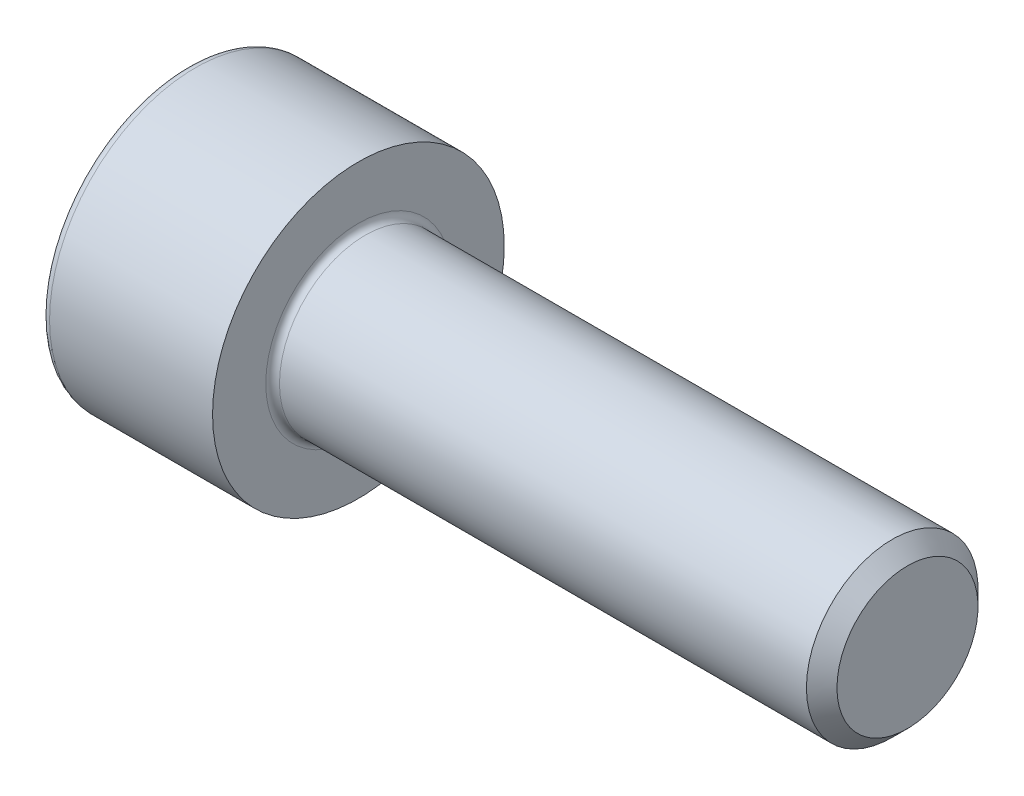
ISO-10303-21;
HEADER;
FILE_DESCRIPTION(('STEP AP214'),'2;1');
FILE_NAME('part.step','',(''),(''),'','','');
FILE_SCHEMA(('AUTOMOTIVE_DESIGN { 1 0 10303 214 1 1 1 1 }'));
ENDSEC;
DATA;
#1=APPLICATION_CONTEXT('core data for automotive mechanical design processes');
#2=APPLICATION_PROTOCOL_DEFINITION('international standard','automotive_design',2000,#1);
#3=PRODUCT_CONTEXT('',#1,'mechanical');
#4=PRODUCT('Part','Part','',(#3));
#5=PRODUCT_RELATED_PRODUCT_CATEGORY('part','',(#4));
#6=PRODUCT_DEFINITION_FORMATION('','',#4);
#7=PRODUCT_DEFINITION_CONTEXT('part definition',#1,'design');
#8=PRODUCT_DEFINITION('design','',#6,#7);
#9=PRODUCT_DEFINITION_SHAPE('','',#8);
#10=(LENGTH_UNIT() NAMED_UNIT(*) SI_UNIT(.MILLI.,.METRE.));
#11=(NAMED_UNIT(*) PLANE_ANGLE_UNIT() SI_UNIT($,.RADIAN.));
#12=(NAMED_UNIT(*) SI_UNIT($,.STERADIAN.) SOLID_ANGLE_UNIT());
#13=UNCERTAINTY_MEASURE_WITH_UNIT(LENGTH_MEASURE(1.E-05),#10,'distance_accuracy_value','');
#14=(GEOMETRIC_REPRESENTATION_CONTEXT(3) GLOBAL_UNCERTAINTY_ASSIGNED_CONTEXT((#13)) GLOBAL_UNIT_ASSIGNED_CONTEXT((#10,
#11,#12)) REPRESENTATION_CONTEXT('',''));
#15=CARTESIAN_POINT('',(0.,0.,0.));
#16=DIRECTION('',(0.,0.,1.));
#17=DIRECTION('',(1.,0.,0.));
#18=AXIS2_PLACEMENT_3D('',#15,#16,#17);
#19=CARTESIAN_POINT('',(0.,0.,0.));
#20=DIRECTION('',(-1.,0.,0.));
#21=DIRECTION('',(0.,0.,1.));
#22=AXIS2_PLACEMENT_3D('',#19,#20,#21);
#23=PLANE('',#22);
#24=DIRECTION('',(0.,-0.499999999999999,0.866025403784439));
#25=VECTOR('',#24,1.);
#26=CARTESIAN_POINT('',(0.,2.35789849937043,0.));
#27=LINE('',#26,#25);
#28=CARTESIAN_POINT('',(0.,2.35789849937043,0.));
#29=VERTEX_POINT('',#28);
#30=CARTESIAN_POINT('',(0.,1.17894924968522,2.042));
#31=VERTEX_POINT('',#30);
#32=EDGE_CURVE('E261',#29,#31,#27,.T.);
#33=ORIENTED_EDGE('',*,*,#32,.T.);
#34=DIRECTION('',(0.,1.,0.));
#35=VECTOR('',#34,1.);
#36=CARTESIAN_POINT('',(0.,-1.17894924968522,2.042));
#37=LINE('',#36,#35);
#38=CARTESIAN_POINT('',(0.,-1.17894924968522,2.042));
#39=VERTEX_POINT('',#38);
#40=EDGE_CURVE('E122',#39,#31,#37,.T.);
#41=ORIENTED_EDGE('',*,*,#40,.F.);
#42=DIRECTION('',(0.,-0.500000000000001,-0.866025403784438));
#43=VECTOR('',#42,1.);
#44=CARTESIAN_POINT('',(0.,-1.17894924968522,2.042));
#45=LINE('',#44,#43);
#46=CARTESIAN_POINT('',(0.,-2.35789849937043,0.));
#47=VERTEX_POINT('',#46);
#48=EDGE_CURVE('E264',#39,#47,#45,.T.);
#49=ORIENTED_EDGE('',*,*,#48,.T.);
#50=DIRECTION('',(0.,0.499999999999999,-0.866025403784439));
#51=VECTOR('',#50,1.);
#52=CARTESIAN_POINT('',(0.,-2.35789849937043,0.));
#53=LINE('',#52,#51);
#54=CARTESIAN_POINT('',(0.,-1.17894924968522,-2.042));
#55=VERTEX_POINT('',#54);
#56=EDGE_CURVE('E267',#47,#55,#53,.T.);
#57=ORIENTED_EDGE('',*,*,#56,.T.);
#58=DIRECTION('',(0.,-1.,0.));
#59=VECTOR('',#58,1.);
#60=CARTESIAN_POINT('',(0.,1.17894924968521,-2.042));
#61=LINE('',#60,#59);
#62=CARTESIAN_POINT('',(0.,1.17894924968521,-2.042));
#63=VERTEX_POINT('',#62);
#64=EDGE_CURVE('E270',#63,#55,#61,.T.);
#65=ORIENTED_EDGE('',*,*,#64,.F.);
#66=DIRECTION('',(0.,-0.500000000000001,-0.866025403784438));
#67=VECTOR('',#66,1.);
#68=CARTESIAN_POINT('',(0.,2.35789849937043,0.));
#69=LINE('',#68,#67);
#70=EDGE_CURVE('E117',#29,#63,#69,.T.);
#71=ORIENTED_EDGE('',*,*,#70,.F.);
#72=EDGE_LOOP('',(#33,#41,#49,#57,#65,#71));
#73=FACE_BOUND('',#72,.T.);
#74=CARTESIAN_POINT('',(0.,0.,0.));
#75=DIRECTION('',(-1.,0.,0.));
#76=DIRECTION('',(0.,0.,1.));
#77=AXIS2_PLACEMENT_3D('',#74,#75,#76);
#78=CIRCLE('',#77,4.);
#79=CARTESIAN_POINT('',(0.,0.,4.));
#80=VERTEX_POINT('',#79);
#81=EDGE_CURVE('E38',#80,#80,#78,.T.);
#82=ORIENTED_EDGE('',*,*,#81,.T.);
#83=EDGE_LOOP('',(#82));
#84=FACE_BOUND('',#83,.T.);
#85=ADVANCED_FACE('F30',(#73,#84),#23,.T.);
#86=CARTESIAN_POINT('',(-31.75,0.,0.));
#87=DIRECTION('',(-1.,0.,0.));
#88=DIRECTION('',(0.,0.,1.));
#89=AXIS2_PLACEMENT_3D('',#86,#87,#88);
#90=CYLINDRICAL_SURFACE('',#89,4.25);
#91=CARTESIAN_POINT('',(0.25,0.,0.));
#92=DIRECTION('',(-1.,0.,0.));
#93=DIRECTION('',(0.,0.,1.));
#94=AXIS2_PLACEMENT_3D('',#91,#92,#93);
#95=CIRCLE('',#94,4.25);
#96=CARTESIAN_POINT('',(0.25,0.,4.25));
#97=VERTEX_POINT('',#96);
#98=EDGE_CURVE('E11',#97,#97,#95,.F.);
#99=ORIENTED_EDGE('',*,*,#98,.T.);
#100=EDGE_LOOP('',(#99));
#101=FACE_BOUND('',#100,.T.);
#102=CARTESIAN_POINT('',(5.,0.,0.));
#103=DIRECTION('',(-1.,0.,0.));
#104=DIRECTION('',(0.,0.,1.));
#105=AXIS2_PLACEMENT_3D('',#102,#103,#104);
#106=CIRCLE('',#105,4.25);
#107=CARTESIAN_POINT('',(5.,0.,4.25));
#108=VERTEX_POINT('',#107);
#109=EDGE_CURVE('E140',#108,#108,#106,.T.);
#110=ORIENTED_EDGE('',*,*,#109,.T.);
#111=EDGE_LOOP('',(#110));
#112=FACE_BOUND('',#111,.T.);
#113=ADVANCED_FACE('F164',(#101,#112),#90,.T.);
#114=CARTESIAN_POINT('',(5.,4.25,0.));
#115=DIRECTION('',(1.,0.,0.));
#116=DIRECTION('',(0.,0.,-1.));
#117=AXIS2_PLACEMENT_3D('',#114,#115,#116);
#118=PLANE('',#117);
#119=CARTESIAN_POINT('',(5.,0.,0.));
#120=DIRECTION('',(1.,0.,0.));
#121=DIRECTION('',(0.,0.,-1.));
#122=AXIS2_PLACEMENT_3D('',#119,#120,#121);
#123=CIRCLE('',#122,2.7);
#124=CARTESIAN_POINT('',(5.,0.,-2.7));
#125=VERTEX_POINT('',#124);
#126=EDGE_CURVE('E143',#125,#125,#123,.F.);
#127=ORIENTED_EDGE('',*,*,#126,.T.);
#128=EDGE_LOOP('',(#127));
#129=FACE_BOUND('',#128,.T.);
#130=ORIENTED_EDGE('',*,*,#109,.F.);
#131=EDGE_LOOP('',(#130));
#132=FACE_BOUND('',#131,.T.);
#133=ADVANCED_FACE('F170',(#129,#132),#118,.T.);
#134=CARTESIAN_POINT('',(-31.75,0.,0.));
#135=DIRECTION('',(-1.,0.,0.));
#136=DIRECTION('',(0.,0.,1.));
#137=AXIS2_PLACEMENT_3D('',#134,#135,#136);
#138=CYLINDRICAL_SURFACE('',#137,2.5);
#139=CARTESIAN_POINT('',(5.2,0.,0.));
#140=DIRECTION('',(1.,0.,0.));
#141=DIRECTION('',(0.,0.,-1.));
#142=AXIS2_PLACEMENT_3D('',#139,#140,#141);
#143=CIRCLE('',#142,2.5);
#144=CARTESIAN_POINT('',(5.2,0.,-2.5));
#145=VERTEX_POINT('',#144);
#146=EDGE_CURVE('E146',#145,#145,#143,.T.);
#147=ORIENTED_EDGE('',*,*,#146,.T.);
#148=EDGE_LOOP('',(#147));
#149=FACE_BOUND('',#148,.T.);
#150=CARTESIAN_POINT('',(20.555,0.,0.));
#151=DIRECTION('',(-1.,0.,0.));
#152=DIRECTION('',(0.,0.,1.));
#153=AXIS2_PLACEMENT_3D('',#150,#151,#152);
#154=CIRCLE('',#153,2.5);
#155=CARTESIAN_POINT('',(20.555,0.,2.5));
#156=VERTEX_POINT('',#155);
#157=EDGE_CURVE('E137',#156,#156,#154,.T.);
#158=ORIENTED_EDGE('',*,*,#157,.T.);
#159=EDGE_LOOP('',(#158));
#160=FACE_BOUND('',#159,.T.);
#161=ADVANCED_FACE('F176',(#149,#160),#138,.T.);
#162=CARTESIAN_POINT('',(21.,0.,0.));
#163=DIRECTION('',(-1.,0.,0.));
#164=DIRECTION('',(0.,0.,1.));
#165=AXIS2_PLACEMENT_3D('',#162,#163,#164);
#166=CONICAL_SURFACE('',#165,2.055,0.785398163397464);
#167=ORIENTED_EDGE('',*,*,#157,.F.);
#168=EDGE_LOOP('',(#167));
#169=FACE_BOUND('',#168,.T.);
#170=CARTESIAN_POINT('',(21.,0.,0.));
#171=DIRECTION('',(-1.,0.,0.));
#172=DIRECTION('',(0.,0.,1.));
#173=AXIS2_PLACEMENT_3D('',#170,#171,#172);
#174=CIRCLE('',#173,2.055);
#175=CARTESIAN_POINT('',(21.,0.,2.055));
#176=VERTEX_POINT('',#175);
#177=EDGE_CURVE('E133',#176,#176,#174,.T.);
#178=ORIENTED_EDGE('',*,*,#177,.T.);
#179=EDGE_LOOP('',(#178));
#180=FACE_BOUND('',#179,.T.);
#181=ADVANCED_FACE('F180',(#169,#180),#166,.T.);
#182=CARTESIAN_POINT('',(21.,2.055,0.));
#183=DIRECTION('',(1.,0.,0.));
#184=DIRECTION('',(0.,0.,-1.));
#185=AXIS2_PLACEMENT_3D('',#182,#183,#184);
#186=PLANE('',#185);
#187=ORIENTED_EDGE('',*,*,#177,.F.);
#188=EDGE_LOOP('',(#187));
#189=FACE_BOUND('',#188,.T.);
#190=ADVANCED_FACE('F160',(#189),#186,.T.);
#191=CARTESIAN_POINT('',(5.2,0.,0.));
#192=DIRECTION('',(1.,0.,0.));
#193=DIRECTION('',(0.,0.,-1.));
#194=AXIS2_PLACEMENT_3D('',#191,#192,#193);
#195=TOROIDAL_SURFACE('',#194,2.7,0.2);
#196=ORIENTED_EDGE('',*,*,#146,.F.);
#197=EDGE_LOOP('',(#196));
#198=FACE_BOUND('',#197,.T.);
#199=ORIENTED_EDGE('',*,*,#126,.F.);
#200=EDGE_LOOP('',(#199));
#201=FACE_BOUND('',#200,.T.);
#202=ADVANCED_FACE('F153',(#198,#201),#195,.F.);
#203=CARTESIAN_POINT('',(0.25,0.,0.));
#204=DIRECTION('',(-1.,0.,0.));
#205=DIRECTION('',(0.,0.,1.));
#206=AXIS2_PLACEMENT_3D('',#203,#204,#205);
#207=TOROIDAL_SURFACE('',#206,4.,0.25);
#208=ORIENTED_EDGE('',*,*,#98,.F.);
#209=EDGE_LOOP('',(#208));
#210=FACE_BOUND('',#209,.T.);
#211=ORIENTED_EDGE('',*,*,#81,.F.);
#212=EDGE_LOOP('',(#211));
#213=FACE_BOUND('',#212,.T.);
#214=ADVANCED_FACE('F32',(#210,#213),#207,.T.);
#215=CARTESIAN_POINT('',(2.5,2.35789849937043,0.));
#216=DIRECTION('',(0.,-0.866025403784439,-0.499999999999999));
#217=DIRECTION('',(0.,0.499999999999999,-0.866025403784439));
#218=AXIS2_PLACEMENT_3D('',#215,#216,#217);
#219=PLANE('',#218);
#220=ORIENTED_EDGE('',*,*,#32,.F.);
#221=DIRECTION('',(-1.,0.,0.));
#222=VECTOR('',#221,1.);
#223=CARTESIAN_POINT('',(2.5,2.35789849937043,0.));
#224=LINE('',#223,#222);
#225=CARTESIAN_POINT('',(2.5,2.35789849937043,0.));
#226=VERTEX_POINT('',#225);
#227=EDGE_CURVE('E260',#226,#29,#224,.T.);
#228=ORIENTED_EDGE('',*,*,#227,.F.);
#229=DIRECTION('',(0.,-0.499999999999999,0.866025403784439));
#230=VECTOR('',#229,1.);
#231=CARTESIAN_POINT('',(2.5,2.35789849937043,0.));
#232=LINE('',#231,#230);
#233=CARTESIAN_POINT('',(2.5,1.76842387452783,1.021));
#234=VERTEX_POINT('',#233);
#235=EDGE_CURVE('E45',#226,#234,#232,.T.);
#236=ORIENTED_EDGE('',*,*,#235,.T.);
#237=CARTESIAN_POINT('',(2.5,1.17894924968522,2.042));
#238=VERTEX_POINT('',#237);
#239=EDGE_CURVE('E103',#234,#238,#232,.T.);
#240=ORIENTED_EDGE('',*,*,#239,.T.);
#241=DIRECTION('',(-1.,0.,0.));
#242=VECTOR('',#241,1.);
#243=CARTESIAN_POINT('',(2.5,1.17894924968522,2.042));
#244=LINE('',#243,#242);
#245=EDGE_CURVE('E115',#238,#31,#244,.T.);
#246=ORIENTED_EDGE('',*,*,#245,.T.);
#247=EDGE_LOOP('',(#220,#228,#236,#240,#246));
#248=FACE_BOUND('',#247,.T.);
#249=ADVANCED_FACE('F114',(#248),#219,.T.);
#250=CARTESIAN_POINT('',(2.5,-1.17894924968522,2.042));
#251=DIRECTION('',(0.,0.,1.));
#252=DIRECTION('',(0.,-1.,0.));
#253=AXIS2_PLACEMENT_3D('',#250,#251,#252);
#254=PLANE('',#253);
#255=ORIENTED_EDGE('',*,*,#40,.T.);
#256=ORIENTED_EDGE('',*,*,#245,.F.);
#257=DIRECTION('',(0.,1.,0.));
#258=VECTOR('',#257,1.);
#259=CARTESIAN_POINT('',(2.5,-1.17894924968522,2.042));
#260=LINE('',#259,#258);
#261=CARTESIAN_POINT('',(2.5,0.,2.042));
#262=VERTEX_POINT('',#261);
#263=EDGE_CURVE('E101',#262,#238,#260,.T.);
#264=ORIENTED_EDGE('',*,*,#263,.F.);
#265=CARTESIAN_POINT('',(2.5,-1.17894924968522,2.042));
#266=VERTEX_POINT('',#265);
#267=EDGE_CURVE('E111',#266,#262,#260,.T.);
#268=ORIENTED_EDGE('',*,*,#267,.F.);
#269=DIRECTION('',(-1.,0.,0.));
#270=VECTOR('',#269,1.);
#271=CARTESIAN_POINT('',(2.5,-1.17894924968522,2.042));
#272=LINE('',#271,#270);
#273=EDGE_CURVE('E124',#266,#39,#272,.T.);
#274=ORIENTED_EDGE('',*,*,#273,.T.);
#275=EDGE_LOOP('',(#255,#256,#264,#268,#274));
#276=FACE_BOUND('',#275,.T.);
#277=ADVANCED_FACE('F119',(#276),#254,.F.);
#278=CARTESIAN_POINT('',(2.5,-1.17894924968522,2.042));
#279=DIRECTION('',(0.,0.866025403784438,-0.500000000000001));
#280=DIRECTION('',(0.,0.500000000000001,0.866025403784438));
#281=AXIS2_PLACEMENT_3D('',#278,#279,#280);
#282=PLANE('',#281);
#283=ORIENTED_EDGE('',*,*,#48,.F.);
#284=ORIENTED_EDGE('',*,*,#273,.F.);
#285=DIRECTION('',(0.,-0.500000000000001,-0.866025403784438));
#286=VECTOR('',#285,1.);
#287=CARTESIAN_POINT('',(2.5,-1.17894924968522,2.042));
#288=LINE('',#287,#286);
#289=CARTESIAN_POINT('',(2.5,-1.76842387452782,1.021));
#290=VERTEX_POINT('',#289);
#291=EDGE_CURVE('E241',#266,#290,#288,.T.);
#292=ORIENTED_EDGE('',*,*,#291,.T.);
#293=CARTESIAN_POINT('',(2.5,-2.35789849937043,0.));
#294=VERTEX_POINT('',#293);
#295=EDGE_CURVE('E243',#290,#294,#288,.T.);
#296=ORIENTED_EDGE('',*,*,#295,.T.);
#297=DIRECTION('',(-1.,0.,0.));
#298=VECTOR('',#297,1.);
#299=CARTESIAN_POINT('',(2.5,-2.35789849937043,0.));
#300=LINE('',#299,#298);
#301=EDGE_CURVE('E129',#294,#47,#300,.T.);
#302=ORIENTED_EDGE('',*,*,#301,.T.);
#303=EDGE_LOOP('',(#283,#284,#292,#296,#302));
#304=FACE_BOUND('',#303,.T.);
#305=ADVANCED_FACE('F193',(#304),#282,.T.);
#306=CARTESIAN_POINT('',(2.5,-2.35789849937043,0.));
#307=DIRECTION('',(0.,0.866025403784439,0.499999999999999));
#308=DIRECTION('',(0.,-0.499999999999999,0.86602540378444));
#309=AXIS2_PLACEMENT_3D('',#306,#307,#308);
#310=PLANE('',#309);
#311=ORIENTED_EDGE('',*,*,#56,.F.);
#312=ORIENTED_EDGE('',*,*,#301,.F.);
#313=DIRECTION('',(0.,0.499999999999999,-0.866025403784439));
#314=VECTOR('',#313,1.);
#315=CARTESIAN_POINT('',(2.5,-2.35789849937043,0.));
#316=LINE('',#315,#314);
#317=CARTESIAN_POINT('',(2.5,-1.76842387452783,-1.021));
#318=VERTEX_POINT('',#317);
#319=EDGE_CURVE('E246',#294,#318,#316,.T.);
#320=ORIENTED_EDGE('',*,*,#319,.T.);
#321=CARTESIAN_POINT('',(2.5,-1.17894924968522,-2.042));
#322=VERTEX_POINT('',#321);
#323=EDGE_CURVE('E250',#318,#322,#316,.T.);
#324=ORIENTED_EDGE('',*,*,#323,.T.);
#325=DIRECTION('',(-1.,0.,0.));
#326=VECTOR('',#325,1.);
#327=CARTESIAN_POINT('',(2.5,-1.17894924968522,-2.042));
#328=LINE('',#327,#326);
#329=EDGE_CURVE('E279',#322,#55,#328,.T.);
#330=ORIENTED_EDGE('',*,*,#329,.T.);
#331=EDGE_LOOP('',(#311,#312,#320,#324,#330));
#332=FACE_BOUND('',#331,.T.);
#333=ADVANCED_FACE('F196',(#332),#310,.T.);
#334=CARTESIAN_POINT('',(2.5,1.17894924968521,-2.042));
#335=DIRECTION('',(0.,0.,-1.));
#336=DIRECTION('',(0.,1.,0.));
#337=AXIS2_PLACEMENT_3D('',#334,#335,#336);
#338=PLANE('',#337);
#339=ORIENTED_EDGE('',*,*,#64,.T.);
#340=ORIENTED_EDGE('',*,*,#329,.F.);
#341=DIRECTION('',(0.,-1.,0.));
#342=VECTOR('',#341,1.);
#343=CARTESIAN_POINT('',(2.5,1.17894924968521,-2.042));
#344=LINE('',#343,#342);
#345=CARTESIAN_POINT('',(2.5,0.,-2.042));
#346=VERTEX_POINT('',#345);
#347=EDGE_CURVE('E254',#346,#322,#344,.T.);
#348=ORIENTED_EDGE('',*,*,#347,.F.);
#349=CARTESIAN_POINT('',(2.5,1.17894924968521,-2.042));
#350=VERTEX_POINT('',#349);
#351=EDGE_CURVE('E255',#350,#346,#344,.T.);
#352=ORIENTED_EDGE('',*,*,#351,.F.);
#353=DIRECTION('',(-1.,0.,0.));
#354=VECTOR('',#353,1.);
#355=CARTESIAN_POINT('',(2.5,1.17894924968521,-2.042));
#356=LINE('',#355,#354);
#357=EDGE_CURVE('E276',#350,#63,#356,.T.);
#358=ORIENTED_EDGE('',*,*,#357,.T.);
#359=EDGE_LOOP('',(#339,#340,#348,#352,#358));
#360=FACE_BOUND('',#359,.T.);
#361=ADVANCED_FACE('F200',(#360),#338,.F.);
#362=CARTESIAN_POINT('',(2.5,2.35789849937043,0.));
#363=DIRECTION('',(0.,0.866025403784438,-0.500000000000001));
#364=DIRECTION('',(0.,0.500000000000001,0.866025403784438));
#365=AXIS2_PLACEMENT_3D('',#362,#363,#364);
#366=PLANE('',#365);
#367=ORIENTED_EDGE('',*,*,#70,.T.);
#368=ORIENTED_EDGE('',*,*,#357,.F.);
#369=DIRECTION('',(0.,-0.500000000000001,-0.866025403784438));
#370=VECTOR('',#369,1.);
#371=CARTESIAN_POINT('',(2.5,2.35789849937043,0.));
#372=LINE('',#371,#370);
#373=CARTESIAN_POINT('',(2.5,1.76842387452782,-1.021));
#374=VERTEX_POINT('',#373);
#375=EDGE_CURVE('E258',#374,#350,#372,.T.);
#376=ORIENTED_EDGE('',*,*,#375,.F.);
#377=EDGE_CURVE('E232',#226,#374,#372,.T.);
#378=ORIENTED_EDGE('',*,*,#377,.F.);
#379=ORIENTED_EDGE('',*,*,#227,.T.);
#380=EDGE_LOOP('',(#367,#368,#376,#378,#379));
#381=FACE_BOUND('',#380,.T.);
#382=ADVANCED_FACE('F204',(#381),#366,.F.);
#383=CARTESIAN_POINT('',(2.5,1.17894924968522,2.042));
#384=DIRECTION('',(-1.,0.,0.));
#385=DIRECTION('',(0.,0.,1.));
#386=AXIS2_PLACEMENT_3D('',#383,#384,#385);
#387=PLANE('',#386);
#388=CARTESIAN_POINT('',(2.5,0.,0.));
#389=DIRECTION('',(-1.,0.,0.));
#390=DIRECTION('',(0.,0.,1.));
#391=AXIS2_PLACEMENT_3D('',#388,#389,#390);
#392=CIRCLE('',#391,2.042);
#393=EDGE_CURVE('E123',#290,#262,#392,.T.);
#394=ORIENTED_EDGE('',*,*,#393,.F.);
#395=ORIENTED_EDGE('',*,*,#291,.F.);
#396=ORIENTED_EDGE('',*,*,#267,.T.);
#397=EDGE_LOOP('',(#394,#395,#396));
#398=FACE_BOUND('',#397,.T.);
#399=ADVANCED_FACE('F208',(#398),#387,.T.);
#400=EDGE_CURVE('E127',#318,#290,#392,.T.);
#401=ORIENTED_EDGE('',*,*,#400,.F.);
#402=ORIENTED_EDGE('',*,*,#319,.F.);
#403=ORIENTED_EDGE('',*,*,#295,.F.);
#404=EDGE_LOOP('',(#401,#402,#403));
#405=FACE_BOUND('',#404,.T.);
#406=ADVANCED_FACE('F211',(#405),#387,.T.);
#407=EDGE_CURVE('E285',#346,#318,#392,.T.);
#408=ORIENTED_EDGE('',*,*,#407,.F.);
#409=ORIENTED_EDGE('',*,*,#347,.T.);
#410=ORIENTED_EDGE('',*,*,#323,.F.);
#411=EDGE_LOOP('',(#408,#409,#410));
#412=FACE_BOUND('',#411,.T.);
#413=ADVANCED_FACE('F216',(#412),#387,.T.);
#414=EDGE_CURVE('E235',#374,#346,#392,.T.);
#415=ORIENTED_EDGE('',*,*,#414,.F.);
#416=ORIENTED_EDGE('',*,*,#375,.T.);
#417=ORIENTED_EDGE('',*,*,#351,.T.);
#418=EDGE_LOOP('',(#415,#416,#417));
#419=FACE_BOUND('',#418,.T.);
#420=ADVANCED_FACE('F223',(#419),#387,.T.);
#421=EDGE_CURVE('E134',#234,#374,#392,.T.);
#422=ORIENTED_EDGE('',*,*,#421,.F.);
#423=ORIENTED_EDGE('',*,*,#235,.F.);
#424=ORIENTED_EDGE('',*,*,#377,.T.);
#425=EDGE_LOOP('',(#422,#423,#424));
#426=FACE_BOUND('',#425,.T.);
#427=ADVANCED_FACE('F219',(#426),#387,.T.);
#428=EDGE_CURVE('E106',#262,#234,#392,.T.);
#429=ORIENTED_EDGE('',*,*,#428,.F.);
#430=ORIENTED_EDGE('',*,*,#263,.T.);
#431=ORIENTED_EDGE('',*,*,#239,.F.);
#432=EDGE_LOOP('',(#429,#430,#431));
#433=FACE_BOUND('',#432,.T.);
#434=ADVANCED_FACE('F102',(#433),#387,.T.);
#435=CARTESIAN_POINT('',(2.5,0.,0.));
#436=DIRECTION('',(-1.,0.,0.));
#437=DIRECTION('',(0.,0.,1.));
#438=AXIS2_PLACEMENT_3D('',#435,#436,#437);
#439=CONICAL_SURFACE('',#438,2.042,1.04719755119659);
#440=CARTESIAN_POINT('',(3.67894924968523,0.,0.));
#441=VERTEX_POINT('',#440);
#442=VERTEX_LOOP('',#441);
#443=FACE_BOUND('',#442,.T.);
#444=ORIENTED_EDGE('',*,*,#428,.T.);
#445=ORIENTED_EDGE('',*,*,#421,.T.);
#446=ORIENTED_EDGE('',*,*,#414,.T.);
#447=ORIENTED_EDGE('',*,*,#407,.T.);
#448=ORIENTED_EDGE('',*,*,#400,.T.);
#449=ORIENTED_EDGE('',*,*,#393,.T.);
#450=EDGE_LOOP('',(#444,#445,#446,#447,#448,#449));
#451=FACE_BOUND('',#450,.T.);
#452=ADVANCED_FACE('F188',(#443,#451),#439,.F.);
#453=CLOSED_SHELL('',(#85,#113,#133,#161,#181,#190,#202,#214,#249,#277,#305,#333,#361,#382,#399,
#406,#413,#420,#427,#434,#452));
#454=MANIFOLD_SOLID_BREP('B2',#453);
#455=ADVANCED_BREP_SHAPE_REPRESENTATION('',(#18,#454),#14);
#456=SHAPE_DEFINITION_REPRESENTATION(#9,#455);
ENDSEC;
END-ISO-10303-21;
